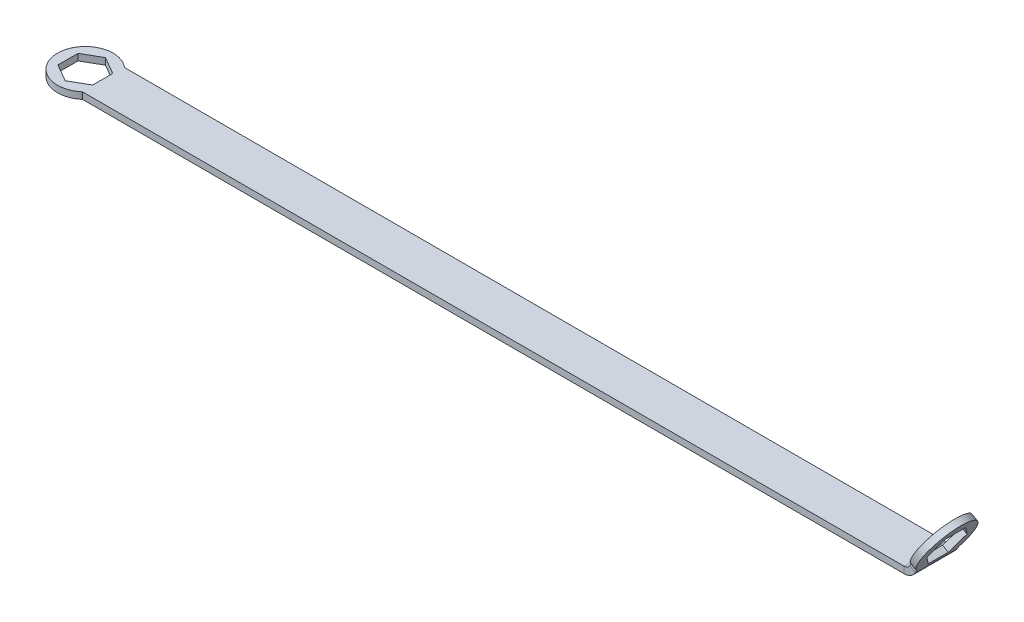
ISO-10303-21;
HEADER;
FILE_DESCRIPTION(('STEP AP214'),'2;1');
FILE_NAME('part.step','',(''),(''),'','','');
FILE_SCHEMA(('AUTOMOTIVE_DESIGN { 1 0 10303 214 1 1 1 1 }'));
ENDSEC;
DATA;
#1=APPLICATION_CONTEXT('core data for automotive mechanical design processes');
#2=APPLICATION_PROTOCOL_DEFINITION('international standard','automotive_design',2000,#1);
#3=PRODUCT_CONTEXT('',#1,'mechanical');
#4=PRODUCT('Part','Part','',(#3));
#5=PRODUCT_RELATED_PRODUCT_CATEGORY('part','',(#4));
#6=PRODUCT_DEFINITION_FORMATION('','',#4);
#7=PRODUCT_DEFINITION_CONTEXT('part definition',#1,'design');
#8=PRODUCT_DEFINITION('design','',#6,#7);
#9=PRODUCT_DEFINITION_SHAPE('','',#8);
#10=(LENGTH_UNIT() NAMED_UNIT(*) SI_UNIT(.MILLI.,.METRE.));
#11=(NAMED_UNIT(*) PLANE_ANGLE_UNIT() SI_UNIT($,.RADIAN.));
#12=(NAMED_UNIT(*) SI_UNIT($,.STERADIAN.) SOLID_ANGLE_UNIT());
#13=UNCERTAINTY_MEASURE_WITH_UNIT(LENGTH_MEASURE(1.E-05),#10,'distance_accuracy_value','');
#14=(GEOMETRIC_REPRESENTATION_CONTEXT(3) GLOBAL_UNCERTAINTY_ASSIGNED_CONTEXT((#13)) GLOBAL_UNIT_ASSIGNED_CONTEXT((#10,
#11,#12)) REPRESENTATION_CONTEXT('',''));
#15=CARTESIAN_POINT('',(0.,0.,0.));
#16=DIRECTION('',(0.,0.,1.));
#17=DIRECTION('',(1.,0.,0.));
#18=AXIS2_PLACEMENT_3D('',#15,#16,#17);
#19=CARTESIAN_POINT('',(47.5532916589868,-81.1957657900333,0.));
#20=DIRECTION('',(-0.86602540378444,0.499999999999998,0.));
#21=DIRECTION('',(0.,0.,1.));
#22=AXIS2_PLACEMENT_3D('',#19,#20,#21);
#23=PLANE('',#22);
#24=DIRECTION('',(0.499999999999998,0.86602540378444,0.));
#25=VECTOR('',#24,1.);
#26=CARTESIAN_POINT('',(47.5532916589868,-81.1957657900333,4.8));
#27=LINE('',#26,#25);
#28=CARTESIAN_POINT('',(94.8647015968123,0.750000000000001,4.8));
#29=VERTEX_POINT('',#28);
#30=CARTESIAN_POINT('',(95.1814166589867,1.29856657920827,4.8));
#31=VERTEX_POINT('',#30);
#32=EDGE_CURVE('E253',#29,#31,#27,.T.);
#33=ORIENTED_EDGE('',*,*,#32,.F.);
#34=DIRECTION('',(0.,0.,-1.));
#35=VECTOR('',#34,1.);
#36=CARTESIAN_POINT('',(94.8647015968123,0.750000000000001,0.));
#37=LINE('',#36,#35);
#38=CARTESIAN_POINT('',(94.8647015968123,0.750000000000001,-4.8));
#39=VERTEX_POINT('',#38);
#40=EDGE_CURVE('E25',#29,#39,#37,.T.);
#41=ORIENTED_EDGE('',*,*,#40,.T.);
#42=DIRECTION('',(0.499999999999998,0.86602540378444,0.));
#43=VECTOR('',#42,1.);
#44=CARTESIAN_POINT('',(47.5532916589868,-81.1957657900333,-4.8));
#45=LINE('',#44,#43);
#46=CARTESIAN_POINT('',(95.1814166589867,1.29856657920827,-4.8));
#47=VERTEX_POINT('',#46);
#48=EDGE_CURVE('E370',#39,#47,#45,.T.);
#49=ORIENTED_EDGE('',*,*,#48,.T.);
#50=CARTESIAN_POINT('',(97.2600279742642,4.89882698645662,0.));
#51=DIRECTION('',(-0.86602540378444,0.499999999999998,0.));
#52=DIRECTION('',(0.,0.,1.));
#53=AXIS2_PLACEMENT_3D('',#50,#51,#52);
#54=CIRCLE('',#53,6.35);
#55=EDGE_CURVE('E366',#31,#47,#54,.T.);
#56=ORIENTED_EDGE('',*,*,#55,.F.);
#57=EDGE_LOOP('',(#33,#41,#49,#56));
#58=FACE_BOUND('',#57,.T.);
#59=DIRECTION('',(0.,0.,1.));
#60=VECTOR('',#59,1.);
#61=CARTESIAN_POINT('',(95.2756529742642,1.46178866518713,0.));
#62=LINE('',#61,#60);
#63=CARTESIAN_POINT('',(95.2756529742642,1.46178866518713,-2.29135888084632));
#64=VERTEX_POINT('',#63);
#65=CARTESIAN_POINT('',(95.2756529742642,1.46178866518713,2.29135888084633));
#66=VERTEX_POINT('',#65);
#67=EDGE_CURVE('E213',#64,#66,#62,.T.);
#68=ORIENTED_EDGE('',*,*,#67,.T.);
#69=DIRECTION('',(0.433012701892217,0.750000000000001,0.500000000000001));
#70=VECTOR('',#69,1.);
#71=CARTESIAN_POINT('',(58.9877882378062,-61.3906367565455,-39.6102580669754));
#72=LINE('',#71,#70);
#73=CARTESIAN_POINT('',(97.2600279742642,4.89882698645664,4.58271776169267));
#74=VERTEX_POINT('',#73);
#75=EDGE_CURVE('E202',#66,#74,#72,.T.);
#76=ORIENTED_EDGE('',*,*,#75,.T.);
#77=DIRECTION('',(0.433012701892218,0.750000000000001,-0.499999999999999));
#78=VECTOR('',#77,1.);
#79=CARTESIAN_POINT('',(60.9721632378061,-57.9535984352761,46.4843347095143));
#80=LINE('',#79,#78);
#81=CARTESIAN_POINT('',(99.2444029742642,8.33586530772613,2.29135888084633));
#82=VERTEX_POINT('',#81);
#83=EDGE_CURVE('E37',#74,#82,#80,.T.);
#84=ORIENTED_EDGE('',*,*,#83,.T.);
#85=DIRECTION('',(0.,0.,1.));
#86=VECTOR('',#85,1.);
#87=CARTESIAN_POINT('',(99.2444029742642,8.33586530772613,0.));
#88=LINE('',#87,#86);
#89=CARTESIAN_POINT('',(99.2444029742642,8.33586530772613,-2.29135888084629));
#90=VERTEX_POINT('',#89);
#91=EDGE_CURVE('E978',#82,#90,#88,.F.);
#92=ORIENTED_EDGE('',*,*,#91,.T.);
#93=DIRECTION('',(-0.433012701892218,-0.750000000000001,-0.500000000000001));
#94=VECTOR('',#93,1.);
#95=CARTESIAN_POINT('',(60.9721632378062,-57.953598435276,-46.4843347095144));
#96=LINE('',#95,#94);
#97=CARTESIAN_POINT('',(97.2600279742642,4.89882698645659,-4.58271776169263));
#98=VERTEX_POINT('',#97);
#99=EDGE_CURVE('E985',#90,#98,#96,.T.);
#100=ORIENTED_EDGE('',*,*,#99,.T.);
#101=DIRECTION('',(-0.433012701892218,-0.750000000000001,0.499999999999999));
#102=VECTOR('',#101,1.);
#103=CARTESIAN_POINT('',(58.9877882378061,-61.3906367565456,39.6102580669754));
#104=LINE('',#103,#102);
#105=EDGE_CURVE('E220',#98,#64,#104,.T.);
#106=ORIENTED_EDGE('',*,*,#105,.T.);
#107=EDGE_LOOP('',(#68,#76,#84,#92,#100,#106));
#108=FACE_BOUND('',#107,.T.);
#109=ADVANCED_FACE('F15',(#58,#108),#23,.F.);
#110=CARTESIAN_POINT('',(46.2542535533102,-80.4457657900333,0.));
#111=DIRECTION('',(-0.86602540378444,0.499999999999998,0.));
#112=DIRECTION('',(0.,0.,1.));
#113=AXIS2_PLACEMENT_3D('',#110,#111,#112);
#114=PLANE('',#113);
#115=DIRECTION('',(0.,0.,-1.));
#116=VECTOR('',#115,1.);
#117=CARTESIAN_POINT('',(93.5656634911357,1.5,0.));
#118=LINE('',#117,#116);
#119=CARTESIAN_POINT('',(93.5656634911357,1.5,4.8));
#120=VERTEX_POINT('',#119);
#121=CARTESIAN_POINT('',(93.5656634911357,1.49999999999999,-4.8));
#122=VERTEX_POINT('',#121);
#123=EDGE_CURVE('E379',#120,#122,#118,.T.);
#124=ORIENTED_EDGE('',*,*,#123,.F.);
#125=DIRECTION('',(0.499999999999998,0.86602540378444,0.));
#126=VECTOR('',#125,1.);
#127=CARTESIAN_POINT('',(46.2542535533102,-80.4457657900333,4.8));
#128=LINE('',#127,#126);
#129=CARTESIAN_POINT('',(93.88237855331,2.04856657920827,4.8));
#130=VERTEX_POINT('',#129);
#131=EDGE_CURVE('E19',#120,#130,#128,.T.);
#132=ORIENTED_EDGE('',*,*,#131,.T.);
#133=CARTESIAN_POINT('',(95.9609898685876,5.64882698645662,0.));
#134=DIRECTION('',(-0.86602540378444,0.499999999999998,0.));
#135=DIRECTION('',(0.,0.,1.));
#136=AXIS2_PLACEMENT_3D('',#133,#134,#135);
#137=CIRCLE('',#136,6.35);
#138=CARTESIAN_POINT('',(93.88237855331,2.04856657920827,-4.8));
#139=VERTEX_POINT('',#138);
#140=EDGE_CURVE('E361',#130,#139,#137,.T.);
#141=ORIENTED_EDGE('',*,*,#140,.T.);
#142=DIRECTION('',(0.499999999999998,0.86602540378444,0.));
#143=VECTOR('',#142,1.);
#144=CARTESIAN_POINT('',(46.2542535533102,-80.4457657900333,-4.8));
#145=LINE('',#144,#143);
#146=EDGE_CURVE('E365',#122,#139,#145,.T.);
#147=ORIENTED_EDGE('',*,*,#146,.F.);
#148=EDGE_LOOP('',(#124,#132,#141,#147));
#149=FACE_BOUND('',#148,.T.);
#150=DIRECTION('',(0.433012701892217,0.750000000000001,0.500000000000001));
#151=VECTOR('',#150,1.);
#152=CARTESIAN_POINT('',(57.6887501321296,-60.6406367565455,-39.6102580669754));
#153=LINE('',#152,#151);
#154=CARTESIAN_POINT('',(93.9766148685876,2.21178866518714,2.29135888084633));
#155=VERTEX_POINT('',#154);
#156=CARTESIAN_POINT('',(95.9609898685876,5.64882698645661,4.58271776169267));
#157=VERTEX_POINT('',#156);
#158=EDGE_CURVE('E209',#155,#157,#153,.T.);
#159=ORIENTED_EDGE('',*,*,#158,.F.);
#160=DIRECTION('',(0.,0.,1.));
#161=VECTOR('',#160,1.);
#162=CARTESIAN_POINT('',(93.9766148685876,2.21178866518713,0.));
#163=LINE('',#162,#161);
#164=CARTESIAN_POINT('',(93.9766148685876,2.21178866518713,-2.29135888084632));
#165=VERTEX_POINT('',#164);
#166=EDGE_CURVE('E47',#165,#155,#163,.T.);
#167=ORIENTED_EDGE('',*,*,#166,.F.);
#168=DIRECTION('',(-0.433012701892218,-0.750000000000001,0.499999999999999));
#169=VECTOR('',#168,1.);
#170=CARTESIAN_POINT('',(57.6887501321295,-60.6406367565456,39.6102580669754));
#171=LINE('',#170,#169);
#172=CARTESIAN_POINT('',(95.9609898685875,5.64882698645659,-4.58271776169263));
#173=VERTEX_POINT('',#172);
#174=EDGE_CURVE('E222',#173,#165,#171,.T.);
#175=ORIENTED_EDGE('',*,*,#174,.F.);
#176=DIRECTION('',(-0.433012701892218,-0.750000000000001,-0.500000000000001));
#177=VECTOR('',#176,1.);
#178=CARTESIAN_POINT('',(59.6731251321295,-57.203598435276,-46.4843347095144));
#179=LINE('',#178,#177);
#180=CARTESIAN_POINT('',(97.9453648685876,9.08586530772613,-2.29135888084629));
#181=VERTEX_POINT('',#180);
#182=EDGE_CURVE('E981',#181,#173,#179,.T.);
#183=ORIENTED_EDGE('',*,*,#182,.F.);
#184=DIRECTION('',(0.,0.,-1.));
#185=VECTOR('',#184,1.);
#186=CARTESIAN_POINT('',(97.9453648685876,9.08586530772613,0.));
#187=LINE('',#186,#185);
#188=CARTESIAN_POINT('',(97.9453648685876,9.08586530772613,2.29135888084633));
#189=VERTEX_POINT('',#188);
#190=EDGE_CURVE('E973',#189,#181,#187,.T.);
#191=ORIENTED_EDGE('',*,*,#190,.F.);
#192=DIRECTION('',(0.433012701892218,0.750000000000001,-0.499999999999999));
#193=VECTOR('',#192,1.);
#194=CARTESIAN_POINT('',(59.6731251321295,-57.2035984352761,46.4843347095143));
#195=LINE('',#194,#193);
#196=EDGE_CURVE('E966',#157,#189,#195,.T.);
#197=ORIENTED_EDGE('',*,*,#196,.F.);
#198=EDGE_LOOP('',(#159,#167,#175,#183,#191,#197));
#199=FACE_BOUND('',#198,.T.);
#200=ADVANCED_FACE('F406',(#149,#199),#114,.T.);
#201=CARTESIAN_POINT('',(95.9609898685876,5.64882698645662,0.));
#202=DIRECTION('',(-0.86602540378444,0.499999999999998,0.));
#203=DIRECTION('',(0.,0.,1.));
#204=AXIS2_PLACEMENT_3D('',#201,#202,#203);
#205=CYLINDRICAL_SURFACE('',#204,6.35);
#206=DIRECTION('',(-0.86602540378444,0.499999999999998,0.));
#207=VECTOR('',#206,1.);
#208=CARTESIAN_POINT('',(93.88237855331,2.04856657920827,4.8));
#209=LINE('',#208,#207);
#210=EDGE_CURVE('E375',#31,#130,#209,.T.);
#211=ORIENTED_EDGE('',*,*,#210,.F.);
#212=ORIENTED_EDGE('',*,*,#55,.T.);
#213=DIRECTION('',(-0.86602540378444,0.499999999999998,0.));
#214=VECTOR('',#213,1.);
#215=CARTESIAN_POINT('',(93.88237855331,2.04856657920827,-4.8));
#216=LINE('',#215,#214);
#217=EDGE_CURVE('E371',#47,#139,#216,.T.);
#218=ORIENTED_EDGE('',*,*,#217,.T.);
#219=ORIENTED_EDGE('',*,*,#140,.F.);
#220=EDGE_LOOP('',(#211,#212,#218,#219));
#221=FACE_BOUND('',#220,.T.);
#222=ADVANCED_FACE('F404',(#221),#205,.T.);
#223=CARTESIAN_POINT('',(46.2542535533102,-80.4457657900333,-4.8));
#224=DIRECTION('',(0.,0.,1.));
#225=DIRECTION('',(0.499999999999998,0.86602540378444,0.));
#226=AXIS2_PLACEMENT_3D('',#223,#224,#225);
#227=PLANE('',#226);
#228=DIRECTION('',(0.86602540378444,-0.499999999999998,0.));
#229=VECTOR('',#228,1.);
#230=CARTESIAN_POINT('',(93.5656634911357,1.5,-4.8));
#231=LINE('',#230,#229);
#232=EDGE_CURVE('E383',#122,#39,#231,.T.);
#233=ORIENTED_EDGE('',*,*,#232,.F.);
#234=ORIENTED_EDGE('',*,*,#146,.T.);
#235=ORIENTED_EDGE('',*,*,#217,.F.);
#236=ORIENTED_EDGE('',*,*,#48,.F.);
#237=EDGE_LOOP('',(#233,#234,#235,#236));
#238=FACE_BOUND('',#237,.T.);
#239=ADVANCED_FACE('F399',(#238),#227,.F.);
#240=CARTESIAN_POINT('',(46.2542535533102,-80.4457657900333,4.8));
#241=DIRECTION('',(0.,0.,1.));
#242=DIRECTION('',(0.499999999999998,0.86602540378444,0.));
#243=AXIS2_PLACEMENT_3D('',#240,#241,#242);
#244=PLANE('',#243);
#245=DIRECTION('',(-0.86602540378444,0.499999999999998,0.));
#246=VECTOR('',#245,1.);
#247=CARTESIAN_POINT('',(93.5656634911357,1.5,4.8));
#248=LINE('',#247,#246);
#249=EDGE_CURVE('E10',#29,#120,#248,.T.);
#250=ORIENTED_EDGE('',*,*,#249,.F.);
#251=ORIENTED_EDGE('',*,*,#32,.T.);
#252=ORIENTED_EDGE('',*,*,#210,.T.);
#253=ORIENTED_EDGE('',*,*,#131,.F.);
#254=EDGE_LOOP('',(#250,#251,#252,#253));
#255=FACE_BOUND('',#254,.T.);
#256=ADVANCED_FACE('F17',(#255),#244,.T.);
#257=CARTESIAN_POINT('',(-99.4134726305552,0.75,0.));
#258=DIRECTION('',(0.,1.,0.));
#259=DIRECTION('',(0.,0.,1.));
#260=AXIS2_PLACEMENT_3D('',#257,#258,#259);
#261=CYLINDRICAL_SURFACE('',#260,6.35);
#262=DIRECTION('',(0.,1.,0.));
#263=VECTOR('',#262,1.);
#264=CARTESIAN_POINT('',(-95.25625,0.75,-4.8));
#265=LINE('',#264,#263);
#266=CARTESIAN_POINT('',(-95.25625,-0.75,-4.8));
#267=VERTEX_POINT('',#266);
#268=CARTESIAN_POINT('',(-95.25625,0.75,-4.8));
#269=VERTEX_POINT('',#268);
#270=EDGE_CURVE('E286',#267,#269,#265,.T.);
#271=ORIENTED_EDGE('',*,*,#270,.F.);
#272=CARTESIAN_POINT('',(-99.4134726305552,-0.75,0.));
#273=DIRECTION('',(0.,1.,0.));
#274=DIRECTION('',(0.,0.,1.));
#275=AXIS2_PLACEMENT_3D('',#272,#273,#274);
#276=CIRCLE('',#275,6.35);
#277=CARTESIAN_POINT('',(-95.25625,-0.75,4.8));
#278=VERTEX_POINT('',#277);
#279=EDGE_CURVE('E354',#267,#278,#276,.T.);
#280=ORIENTED_EDGE('',*,*,#279,.T.);
#281=DIRECTION('',(0.,1.,0.));
#282=VECTOR('',#281,1.);
#283=CARTESIAN_POINT('',(-95.25625,0.75,4.8));
#284=LINE('',#283,#282);
#285=CARTESIAN_POINT('',(-95.25625,0.75,4.8));
#286=VERTEX_POINT('',#285);
#287=EDGE_CURVE('E351',#278,#286,#284,.T.);
#288=ORIENTED_EDGE('',*,*,#287,.T.);
#289=CARTESIAN_POINT('',(-99.4134726305552,0.75,0.));
#290=DIRECTION('',(0.,1.,0.));
#291=DIRECTION('',(0.,0.,1.));
#292=AXIS2_PLACEMENT_3D('',#289,#290,#291);
#293=CIRCLE('',#292,6.35);
#294=EDGE_CURVE('E297',#269,#286,#293,.T.);
#295=ORIENTED_EDGE('',*,*,#294,.F.);
#296=EDGE_LOOP('',(#271,#280,#288,#295));
#297=FACE_BOUND('',#296,.T.);
#298=ADVANCED_FACE('F492',(#297),#261,.T.);
#299=CARTESIAN_POINT('',(-22.8689931576388,0.75,-39.6102580669754));
#300=DIRECTION('',(0.5,0.,0.866025403784439));
#301=DIRECTION('',(0.866025403784439,0.,-0.5));
#302=AXIS2_PLACEMENT_3D('',#299,#300,#301);
#303=PLANE('',#302);
#304=DIRECTION('',(0.,1.,0.));
#305=VECTOR('',#304,1.);
#306=CARTESIAN_POINT('',(-95.4447226305551,0.75,2.29135888084631));
#307=LINE('',#306,#305);
#308=CARTESIAN_POINT('',(-95.4447226305551,-0.75,2.29135888084631));
#309=VERTEX_POINT('',#308);
#310=CARTESIAN_POINT('',(-95.4447226305551,0.75,2.29135888084631));
#311=VERTEX_POINT('',#310);
#312=EDGE_CURVE('E341',#309,#311,#307,.T.);
#313=ORIENTED_EDGE('',*,*,#312,.F.);
#314=DIRECTION('',(0.866025403784439,0.,-0.5));
#315=VECTOR('',#314,1.);
#316=CARTESIAN_POINT('',(-22.8689931576388,-0.75,-39.6102580669754));
#317=LINE('',#316,#315);
#318=CARTESIAN_POINT('',(-99.4134726305552,-0.75,4.58271776169265));
#319=VERTEX_POINT('',#318);
#320=EDGE_CURVE('E274',#319,#309,#317,.T.);
#321=ORIENTED_EDGE('',*,*,#320,.F.);
#322=DIRECTION('',(0.,1.,0.));
#323=VECTOR('',#322,1.);
#324=CARTESIAN_POINT('',(-99.4134726305552,0.75,4.58271776169265));
#325=LINE('',#324,#323);
#326=CARTESIAN_POINT('',(-99.4134726305552,0.75,4.58271776169265));
#327=VERTEX_POINT('',#326);
#328=EDGE_CURVE('E348',#319,#327,#325,.T.);
#329=ORIENTED_EDGE('',*,*,#328,.T.);
#330=DIRECTION('',(0.866025403784439,0.,-0.5));
#331=VECTOR('',#330,1.);
#332=CARTESIAN_POINT('',(-22.8689931576388,0.75,-39.6102580669754));
#333=LINE('',#332,#331);
#334=EDGE_CURVE('E344',#327,#311,#333,.T.);
#335=ORIENTED_EDGE('',*,*,#334,.T.);
#336=EDGE_LOOP('',(#313,#321,#329,#335));
#337=FACE_BOUND('',#336,.T.);
#338=ADVANCED_FACE('F488',(#337),#303,.F.);
#339=CARTESIAN_POINT('',(-95.4447226305552,0.75,0.));
#340=DIRECTION('',(1.,0.,0.));
#341=DIRECTION('',(0.,0.,-1.));
#342=AXIS2_PLACEMENT_3D('',#339,#340,#341);
#343=PLANE('',#342);
#344=DIRECTION('',(0.,1.,0.));
#345=VECTOR('',#344,1.);
#346=CARTESIAN_POINT('',(-95.4447226305552,0.75,-2.29135888084632));
#347=LINE('',#346,#345);
#348=CARTESIAN_POINT('',(-95.4447226305552,-0.75,-2.29135888084632));
#349=VERTEX_POINT('',#348);
#350=CARTESIAN_POINT('',(-95.4447226305552,0.75,-2.29135888084632));
#351=VERTEX_POINT('',#350);
#352=EDGE_CURVE('E334',#349,#351,#347,.T.);
#353=ORIENTED_EDGE('',*,*,#352,.F.);
#354=DIRECTION('',(0.,0.,1.));
#355=VECTOR('',#354,1.);
#356=CARTESIAN_POINT('',(-95.4447226305551,-0.75,0.));
#357=LINE('',#356,#355);
#358=EDGE_CURVE('E270',#309,#349,#357,.F.);
#359=ORIENTED_EDGE('',*,*,#358,.F.);
#360=ORIENTED_EDGE('',*,*,#312,.T.);
#361=DIRECTION('',(0.,0.,-1.));
#362=VECTOR('',#361,1.);
#363=CARTESIAN_POINT('',(-95.4447226305552,0.75,0.));
#364=LINE('',#363,#362);
#365=EDGE_CURVE('E337',#311,#351,#364,.T.);
#366=ORIENTED_EDGE('',*,*,#365,.T.);
#367=EDGE_LOOP('',(#353,#359,#360,#366));
#368=FACE_BOUND('',#367,.T.);
#369=ADVANCED_FACE('F484',(#368),#343,.F.);
#370=CARTESIAN_POINT('',(-22.8689931576388,0.75,39.6102580669754));
#371=DIRECTION('',(0.5,0.,-0.866025403784439));
#372=DIRECTION('',(-0.866025403784439,0.,-0.5));
#373=AXIS2_PLACEMENT_3D('',#370,#371,#372);
#374=PLANE('',#373);
#375=DIRECTION('',(0.,1.,0.));
#376=VECTOR('',#375,1.);
#377=CARTESIAN_POINT('',(-99.4134726305552,0.75,-4.58271776169264));
#378=LINE('',#377,#376);
#379=CARTESIAN_POINT('',(-99.4134726305552,-0.75,-4.58271776169264));
#380=VERTEX_POINT('',#379);
#381=CARTESIAN_POINT('',(-99.4134726305552,0.75,-4.58271776169264));
#382=VERTEX_POINT('',#381);
#383=EDGE_CURVE('E327',#380,#382,#378,.T.);
#384=ORIENTED_EDGE('',*,*,#383,.F.);
#385=DIRECTION('',(-0.866025403784439,0.,-0.5));
#386=VECTOR('',#385,1.);
#387=CARTESIAN_POINT('',(-22.8689931576388,-0.75,39.6102580669754));
#388=LINE('',#387,#386);
#389=EDGE_CURVE('E266',#349,#380,#388,.T.);
#390=ORIENTED_EDGE('',*,*,#389,.F.);
#391=ORIENTED_EDGE('',*,*,#352,.T.);
#392=DIRECTION('',(-0.866025403784439,0.,-0.5));
#393=VECTOR('',#392,1.);
#394=CARTESIAN_POINT('',(-22.8689931576388,0.75,39.6102580669754));
#395=LINE('',#394,#393);
#396=EDGE_CURVE('E330',#351,#382,#395,.T.);
#397=ORIENTED_EDGE('',*,*,#396,.T.);
#398=EDGE_LOOP('',(#384,#390,#391,#397));
#399=FACE_BOUND('',#398,.T.);
#400=ADVANCED_FACE('F480',(#399),#374,.F.);
#401=CARTESIAN_POINT('',(-26.8377431576386,0.75,-46.4843347095143));
#402=DIRECTION('',(-0.499999999999999,0.,-0.86602540378444));
#403=DIRECTION('',(-0.86602540378444,0.,0.499999999999999));
#404=AXIS2_PLACEMENT_3D('',#401,#402,#403);
#405=PLANE('',#404);
#406=DIRECTION('',(0.,1.,0.));
#407=VECTOR('',#406,1.);
#408=CARTESIAN_POINT('',(-103.382222630555,0.75,-2.29135888084632));
#409=LINE('',#408,#407);
#410=CARTESIAN_POINT('',(-103.382222630555,-0.75,-2.29135888084632));
#411=VERTEX_POINT('',#410);
#412=CARTESIAN_POINT('',(-103.382222630555,0.75,-2.29135888084632));
#413=VERTEX_POINT('',#412);
#414=EDGE_CURVE('E320',#411,#413,#409,.T.);
#415=ORIENTED_EDGE('',*,*,#414,.F.);
#416=DIRECTION('',(-0.86602540378444,0.,0.499999999999999));
#417=VECTOR('',#416,1.);
#418=CARTESIAN_POINT('',(-26.8377431576386,-0.75,-46.4843347095143));
#419=LINE('',#418,#417);
#420=EDGE_CURVE('E262',#380,#411,#419,.T.);
#421=ORIENTED_EDGE('',*,*,#420,.F.);
#422=ORIENTED_EDGE('',*,*,#383,.T.);
#423=DIRECTION('',(-0.86602540378444,0.,0.499999999999999));
#424=VECTOR('',#423,1.);
#425=CARTESIAN_POINT('',(-26.8377431576386,0.75,-46.4843347095143));
#426=LINE('',#425,#424);
#427=EDGE_CURVE('E323',#382,#413,#426,.T.);
#428=ORIENTED_EDGE('',*,*,#427,.T.);
#429=EDGE_LOOP('',(#415,#421,#422,#428));
#430=FACE_BOUND('',#429,.T.);
#431=ADVANCED_FACE('F476',(#430),#405,.F.);
#432=CARTESIAN_POINT('',(-103.382222630555,0.75,3.13071112683395E-13));
#433=DIRECTION('',(-1.,0.,0.));
#434=DIRECTION('',(0.,0.,1.));
#435=AXIS2_PLACEMENT_3D('',#432,#433,#434);
#436=PLANE('',#435);
#437=DIRECTION('',(0.,0.,1.));
#438=VECTOR('',#437,1.);
#439=CARTESIAN_POINT('',(-103.382222630555,-0.75,0.));
#440=LINE('',#439,#438);
#441=CARTESIAN_POINT('',(-103.382222630555,-0.75,2.29135888084633));
#442=VERTEX_POINT('',#441);
#443=EDGE_CURVE('E258',#411,#442,#440,.T.);
#444=ORIENTED_EDGE('',*,*,#443,.F.);
#445=ORIENTED_EDGE('',*,*,#414,.T.);
#446=DIRECTION('',(0.,0.,1.));
#447=VECTOR('',#446,1.);
#448=CARTESIAN_POINT('',(-103.382222630555,0.75,3.13071112683395E-13));
#449=LINE('',#448,#447);
#450=CARTESIAN_POINT('',(-103.382222630555,0.75,2.29135888084633));
#451=VERTEX_POINT('',#450);
#452=EDGE_CURVE('E316',#413,#451,#449,.T.);
#453=ORIENTED_EDGE('',*,*,#452,.T.);
#454=DIRECTION('',(0.,1.,0.));
#455=VECTOR('',#454,1.);
#456=CARTESIAN_POINT('',(-103.382222630555,0.75,2.29135888084633));
#457=LINE('',#456,#455);
#458=EDGE_CURVE('E313',#442,#451,#457,.T.);
#459=ORIENTED_EDGE('',*,*,#458,.F.);
#460=EDGE_LOOP('',(#444,#445,#453,#459));
#461=FACE_BOUND('',#460,.T.);
#462=ADVANCED_FACE('F472',(#461),#436,.F.);
#463=CARTESIAN_POINT('',(-26.8377431576388,0.75,46.4843347095144));
#464=DIRECTION('',(-0.5,0.,0.866025403784439));
#465=DIRECTION('',(0.866025403784439,0.,0.5));
#466=AXIS2_PLACEMENT_3D('',#463,#464,#465);
#467=PLANE('',#466);
#468=ORIENTED_EDGE('',*,*,#328,.F.);
#469=DIRECTION('',(0.866025403784439,0.,0.5));
#470=VECTOR('',#469,1.);
#471=CARTESIAN_POINT('',(-26.8377431576388,-0.75,46.4843347095144));
#472=LINE('',#471,#470);
#473=EDGE_CURVE('E278',#442,#319,#472,.T.);
#474=ORIENTED_EDGE('',*,*,#473,.F.);
#475=ORIENTED_EDGE('',*,*,#458,.T.);
#476=DIRECTION('',(0.866025403784439,0.,0.5));
#477=VECTOR('',#476,1.);
#478=CARTESIAN_POINT('',(-26.8377431576388,0.75,46.4843347095144));
#479=LINE('',#478,#477);
#480=EDGE_CURVE('E309',#451,#327,#479,.T.);
#481=ORIENTED_EDGE('',*,*,#480,.T.);
#482=EDGE_LOOP('',(#468,#474,#475,#481));
#483=FACE_BOUND('',#482,.T.);
#484=ADVANCED_FACE('F468',(#483),#467,.F.);
#485=CARTESIAN_POINT('',(0.,0.75,0.));
#486=DIRECTION('',(0.,1.,0.));
#487=DIRECTION('',(0.,0.,1.));
#488=AXIS2_PLACEMENT_3D('',#485,#486,#487);
#489=PLANE('',#488);
#490=ORIENTED_EDGE('',*,*,#480,.F.);
#491=ORIENTED_EDGE('',*,*,#452,.F.);
#492=ORIENTED_EDGE('',*,*,#427,.F.);
#493=ORIENTED_EDGE('',*,*,#396,.F.);
#494=ORIENTED_EDGE('',*,*,#365,.F.);
#495=ORIENTED_EDGE('',*,*,#334,.F.);
#496=EDGE_LOOP('',(#490,#491,#492,#493,#494,#495));
#497=FACE_BOUND('',#496,.T.);
#498=DIRECTION('',(1.,0.,0.));
#499=VECTOR('',#498,1.);
#500=CARTESIAN_POINT('',(0.,0.75,4.8));
#501=LINE('',#500,#499);
#502=CARTESIAN_POINT('',(92.266625385459,0.75,4.8));
#503=VERTEX_POINT('',#502);
#504=EDGE_CURVE('E305',#286,#503,#501,.T.);
#505=ORIENTED_EDGE('',*,*,#504,.T.);
#506=DIRECTION('',(0.,0.,-1.));
#507=VECTOR('',#506,1.);
#508=CARTESIAN_POINT('',(92.266625385459,0.75,0.));
#509=LINE('',#508,#507);
#510=CARTESIAN_POINT('',(92.266625385459,0.75,-4.8));
#511=VERTEX_POINT('',#510);
#512=EDGE_CURVE('E301',#503,#511,#509,.T.);
#513=ORIENTED_EDGE('',*,*,#512,.T.);
#514=DIRECTION('',(1.,0.,0.));
#515=VECTOR('',#514,1.);
#516=CARTESIAN_POINT('',(0.,0.75,-4.8));
#517=LINE('',#516,#515);
#518=EDGE_CURVE('E293',#269,#511,#517,.T.);
#519=ORIENTED_EDGE('',*,*,#518,.F.);
#520=ORIENTED_EDGE('',*,*,#294,.T.);
#521=EDGE_LOOP('',(#505,#513,#519,#520));
#522=FACE_BOUND('',#521,.T.);
#523=ADVANCED_FACE('F435',(#497,#522),#489,.T.);
#524=CARTESIAN_POINT('',(0.,0.75,-4.8));
#525=DIRECTION('',(0.,0.,1.));
#526=DIRECTION('',(1.,0.,0.));
#527=AXIS2_PLACEMENT_3D('',#524,#525,#526);
#528=PLANE('',#527);
#529=ORIENTED_EDGE('',*,*,#518,.T.);
#530=DIRECTION('',(0.,-1.,0.));
#531=VECTOR('',#530,1.);
#532=CARTESIAN_POINT('',(92.266625385459,0.75,-4.8));
#533=LINE('',#532,#531);
#534=CARTESIAN_POINT('',(92.266625385459,-0.75,-4.8));
#535=VERTEX_POINT('',#534);
#536=EDGE_CURVE('E289',#511,#535,#533,.T.);
#537=ORIENTED_EDGE('',*,*,#536,.T.);
#538=DIRECTION('',(1.,0.,0.));
#539=VECTOR('',#538,1.);
#540=CARTESIAN_POINT('',(0.,-0.75,-4.8));
#541=LINE('',#540,#539);
#542=EDGE_CURVE('E282',#267,#535,#541,.T.);
#543=ORIENTED_EDGE('',*,*,#542,.F.);
#544=ORIENTED_EDGE('',*,*,#270,.T.);
#545=EDGE_LOOP('',(#529,#537,#543,#544));
#546=FACE_BOUND('',#545,.T.);
#547=ADVANCED_FACE('F429',(#546),#528,.F.);
#548=CARTESIAN_POINT('',(0.,-0.75,0.));
#549=DIRECTION('',(0.,1.,0.));
#550=DIRECTION('',(0.,0.,1.));
#551=AXIS2_PLACEMENT_3D('',#548,#549,#550);
#552=PLANE('',#551);
#553=DIRECTION('',(0.,0.,-1.));
#554=VECTOR('',#553,1.);
#555=CARTESIAN_POINT('',(92.266625385459,-0.75,0.));
#556=LINE('',#555,#554);
#557=CARTESIAN_POINT('',(92.266625385459,-0.75,4.8));
#558=VERTEX_POINT('',#557);
#559=EDGE_CURVE('E243',#558,#535,#556,.T.);
#560=ORIENTED_EDGE('',*,*,#559,.F.);
#561=DIRECTION('',(1.,0.,0.));
#562=VECTOR('',#561,1.);
#563=CARTESIAN_POINT('',(0.,-0.75,4.8));
#564=LINE('',#563,#562);
#565=EDGE_CURVE('E254',#278,#558,#564,.T.);
#566=ORIENTED_EDGE('',*,*,#565,.F.);
#567=ORIENTED_EDGE('',*,*,#279,.F.);
#568=ORIENTED_EDGE('',*,*,#542,.T.);
#569=EDGE_LOOP('',(#560,#566,#567,#568));
#570=FACE_BOUND('',#569,.T.);
#571=ORIENTED_EDGE('',*,*,#473,.T.);
#572=ORIENTED_EDGE('',*,*,#320,.T.);
#573=ORIENTED_EDGE('',*,*,#358,.T.);
#574=ORIENTED_EDGE('',*,*,#389,.T.);
#575=ORIENTED_EDGE('',*,*,#420,.T.);
#576=ORIENTED_EDGE('',*,*,#443,.T.);
#577=EDGE_LOOP('',(#571,#572,#573,#574,#575,#576));
#578=FACE_BOUND('',#577,.T.);
#579=ADVANCED_FACE('F426',(#570,#578),#552,.F.);
#580=CARTESIAN_POINT('',(0.,0.75,4.8));
#581=DIRECTION('',(0.,0.,1.));
#582=DIRECTION('',(1.,0.,0.));
#583=AXIS2_PLACEMENT_3D('',#580,#581,#582);
#584=PLANE('',#583);
#585=ORIENTED_EDGE('',*,*,#565,.T.);
#586=DIRECTION('',(0.,1.,0.));
#587=VECTOR('',#586,1.);
#588=CARTESIAN_POINT('',(92.266625385459,0.75,4.8));
#589=LINE('',#588,#587);
#590=EDGE_CURVE('E249',#558,#503,#589,.T.);
#591=ORIENTED_EDGE('',*,*,#590,.T.);
#592=ORIENTED_EDGE('',*,*,#504,.F.);
#593=ORIENTED_EDGE('',*,*,#287,.F.);
#594=EDGE_LOOP('',(#585,#591,#592,#593));
#595=FACE_BOUND('',#594,.T.);
#596=ADVANCED_FACE('F439',(#595),#584,.T.);
#597=CARTESIAN_POINT('',(92.266625385459,2.25,4.8));
#598=DIRECTION('',(0.,0.,-1.));
#599=DIRECTION('',(-1.,0.,0.));
#600=AXIS2_PLACEMENT_3D('',#597,#598,#599);
#601=PLANE('',#600);
#602=ORIENTED_EDGE('',*,*,#590,.F.);
#603=CARTESIAN_POINT('',(92.266625385459,2.25,4.8));
#604=DIRECTION('',(0.,0.,-1.));
#605=DIRECTION('',(-1.,0.,0.));
#606=AXIS2_PLACEMENT_3D('',#603,#604,#605);
#607=CIRCLE('',#606,3.);
#608=EDGE_CURVE('E228',#558,#29,#607,.F.);
#609=ORIENTED_EDGE('',*,*,#608,.T.);
#610=ORIENTED_EDGE('',*,*,#249,.T.);
#611=CARTESIAN_POINT('',(92.266625385459,2.25,4.8));
#612=DIRECTION('',(0.,0.,1.));
#613=DIRECTION('',(1.,0.,0.));
#614=AXIS2_PLACEMENT_3D('',#611,#612,#613);
#615=CIRCLE('',#614,1.5);
#616=EDGE_CURVE('E234',#503,#120,#615,.T.);
#617=ORIENTED_EDGE('',*,*,#616,.F.);
#618=EDGE_LOOP('',(#602,#609,#610,#617));
#619=FACE_BOUND('',#618,.T.);
#620=ADVANCED_FACE('F441',(#619),#601,.F.);
#621=CARTESIAN_POINT('',(92.266625385459,2.25,-4.8));
#622=DIRECTION('',(0.,0.,1.));
#623=DIRECTION('',(1.,0.,0.));
#624=AXIS2_PLACEMENT_3D('',#621,#622,#623);
#625=PLANE('',#624);
#626=CARTESIAN_POINT('',(92.266625385459,2.25,-4.8));
#627=DIRECTION('',(0.,0.,-1.));
#628=DIRECTION('',(-1.,0.,0.));
#629=AXIS2_PLACEMENT_3D('',#626,#627,#628);
#630=CIRCLE('',#629,3.);
#631=EDGE_CURVE('E239',#39,#535,#630,.T.);
#632=ORIENTED_EDGE('',*,*,#631,.T.);
#633=ORIENTED_EDGE('',*,*,#536,.F.);
#634=CARTESIAN_POINT('',(92.266625385459,2.25,-4.8));
#635=DIRECTION('',(0.,0.,-1.));
#636=DIRECTION('',(1.,0.,0.));
#637=AXIS2_PLACEMENT_3D('',#634,#635,#636);
#638=CIRCLE('',#637,1.5);
#639=EDGE_CURVE('E238',#122,#511,#638,.T.);
#640=ORIENTED_EDGE('',*,*,#639,.F.);
#641=ORIENTED_EDGE('',*,*,#232,.T.);
#642=EDGE_LOOP('',(#632,#633,#640,#641));
#643=FACE_BOUND('',#642,.T.);
#644=ADVANCED_FACE('F419',(#643),#625,.F.);
#645=CARTESIAN_POINT('',(92.266625385459,2.25,9.9980824399288));
#646=DIRECTION('',(0.,0.,-1.));
#647=DIRECTION('',(-1.,0.,0.));
#648=AXIS2_PLACEMENT_3D('',#645,#646,#647);
#649=CYLINDRICAL_SURFACE('',#648,1.5);
#650=ORIENTED_EDGE('',*,*,#123,.T.);
#651=ORIENTED_EDGE('',*,*,#639,.T.);
#652=ORIENTED_EDGE('',*,*,#512,.F.);
#653=ORIENTED_EDGE('',*,*,#616,.T.);
#654=EDGE_LOOP('',(#650,#651,#652,#653));
#655=FACE_BOUND('',#654,.T.);
#656=ADVANCED_FACE('F432',(#655),#649,.F.);
#657=CARTESIAN_POINT('',(92.266625385459,2.25,9.9980824399288));
#658=DIRECTION('',(0.,0.,-1.));
#659=DIRECTION('',(-1.,0.,0.));
#660=AXIS2_PLACEMENT_3D('',#657,#658,#659);
#661=CYLINDRICAL_SURFACE('',#660,3.);
#662=ORIENTED_EDGE('',*,*,#40,.F.);
#663=ORIENTED_EDGE('',*,*,#608,.F.);
#664=ORIENTED_EDGE('',*,*,#559,.T.);
#665=ORIENTED_EDGE('',*,*,#631,.F.);
#666=EDGE_LOOP('',(#662,#663,#664,#665));
#667=FACE_BOUND('',#666,.T.);
#668=ADVANCED_FACE('F420',(#667),#661,.T.);
#669=CARTESIAN_POINT('',(93.9766148685876,2.21178866518713,0.));
#670=DIRECTION('',(-0.499999999999998,-0.86602540378444,0.));
#671=DIRECTION('',(0.,0.,1.));
#672=AXIS2_PLACEMENT_3D('',#669,#670,#671);
#673=PLANE('',#672);
#674=ORIENTED_EDGE('',*,*,#67,.F.);
#675=DIRECTION('',(-0.86602540378444,0.499999999999998,0.));
#676=VECTOR('',#675,1.);
#677=CARTESIAN_POINT('',(93.9766148685876,2.21178866518713,-2.29135888084632));
#678=LINE('',#677,#676);
#679=EDGE_CURVE('E984',#64,#165,#678,.T.);
#680=ORIENTED_EDGE('',*,*,#679,.T.);
#681=ORIENTED_EDGE('',*,*,#166,.T.);
#682=DIRECTION('',(-0.86602540378444,0.499999999999998,0.));
#683=VECTOR('',#682,1.);
#684=CARTESIAN_POINT('',(93.9766148685876,2.21178866518713,2.29135888084633));
#685=LINE('',#684,#683);
#686=EDGE_CURVE('E204',#66,#155,#685,.T.);
#687=ORIENTED_EDGE('',*,*,#686,.F.);
#688=EDGE_LOOP('',(#674,#680,#681,#687));
#689=FACE_BOUND('',#688,.T.);
#690=ADVANCED_FACE('F212',(#689),#673,.F.);
#691=CARTESIAN_POINT('',(57.6887501321295,-60.6406367565456,39.6102580669754));
#692=DIRECTION('',(-0.249999999999999,-0.433012701892219,-0.866025403784439));
#693=DIRECTION('',(-0.433012701892218,-0.750000000000001,0.499999999999999));
#694=AXIS2_PLACEMENT_3D('',#691,#692,#693);
#695=PLANE('',#694);
#696=ORIENTED_EDGE('',*,*,#679,.F.);
#697=ORIENTED_EDGE('',*,*,#105,.F.);
#698=DIRECTION('',(-0.86602540378444,0.499999999999998,0.));
#699=VECTOR('',#698,1.);
#700=CARTESIAN_POINT('',(95.9609898685875,5.64882698645659,-4.58271776169263));
#701=LINE('',#700,#699);
#702=EDGE_CURVE('E977',#98,#173,#701,.T.);
#703=ORIENTED_EDGE('',*,*,#702,.T.);
#704=ORIENTED_EDGE('',*,*,#174,.T.);
#705=EDGE_LOOP('',(#696,#697,#703,#704));
#706=FACE_BOUND('',#705,.T.);
#707=ADVANCED_FACE('F534',(#706),#695,.F.);
#708=CARTESIAN_POINT('',(59.6731251321295,-57.203598435276,-46.4843347095144));
#709=DIRECTION('',(0.249999999999999,0.43301270189222,-0.866025403784438));
#710=DIRECTION('',(-0.433012701892218,-0.750000000000001,-0.500000000000001));
#711=AXIS2_PLACEMENT_3D('',#708,#709,#710);
#712=PLANE('',#711);
#713=ORIENTED_EDGE('',*,*,#702,.F.);
#714=ORIENTED_EDGE('',*,*,#99,.F.);
#715=DIRECTION('',(-0.86602540378444,0.499999999999998,0.));
#716=VECTOR('',#715,1.);
#717=CARTESIAN_POINT('',(97.9453648685876,9.08586530772613,-2.29135888084629));
#718=LINE('',#717,#716);
#719=EDGE_CURVE('E970',#90,#181,#718,.T.);
#720=ORIENTED_EDGE('',*,*,#719,.T.);
#721=ORIENTED_EDGE('',*,*,#182,.T.);
#722=EDGE_LOOP('',(#713,#714,#720,#721));
#723=FACE_BOUND('',#722,.T.);
#724=ADVANCED_FACE('F546',(#723),#712,.F.);
#725=CARTESIAN_POINT('',(97.9453648685876,9.08586530772613,0.));
#726=DIRECTION('',(0.499999999999998,0.86602540378444,0.));
#727=DIRECTION('',(0.,0.,-1.));
#728=AXIS2_PLACEMENT_3D('',#725,#726,#727);
#729=PLANE('',#728);
#730=ORIENTED_EDGE('',*,*,#719,.F.);
#731=ORIENTED_EDGE('',*,*,#91,.F.);
#732=DIRECTION('',(-0.86602540378444,0.499999999999998,0.));
#733=VECTOR('',#732,1.);
#734=CARTESIAN_POINT('',(97.9453648685876,9.08586530772613,2.29135888084633));
#735=LINE('',#734,#733);
#736=EDGE_CURVE('E216',#82,#189,#735,.T.);
#737=ORIENTED_EDGE('',*,*,#736,.T.);
#738=ORIENTED_EDGE('',*,*,#190,.T.);
#739=EDGE_LOOP('',(#730,#731,#737,#738));
#740=FACE_BOUND('',#739,.T.);
#741=ADVANCED_FACE('F557',(#740),#729,.F.);
#742=CARTESIAN_POINT('',(59.6731251321295,-57.2035984352761,46.4843347095143));
#743=DIRECTION('',(0.249999999999999,0.433012701892219,0.866025403784439));
#744=DIRECTION('',(0.433012701892218,0.750000000000001,-0.499999999999999));
#745=AXIS2_PLACEMENT_3D('',#742,#743,#744);
#746=PLANE('',#745);
#747=ORIENTED_EDGE('',*,*,#736,.F.);
#748=ORIENTED_EDGE('',*,*,#83,.F.);
#749=DIRECTION('',(-0.86602540378444,0.499999999999998,0.));
#750=VECTOR('',#749,1.);
#751=CARTESIAN_POINT('',(95.9609898685876,5.64882698645661,4.58271776169267));
#752=LINE('',#751,#750);
#753=EDGE_CURVE('E206',#74,#157,#752,.T.);
#754=ORIENTED_EDGE('',*,*,#753,.T.);
#755=ORIENTED_EDGE('',*,*,#196,.T.);
#756=EDGE_LOOP('',(#747,#748,#754,#755));
#757=FACE_BOUND('',#756,.T.);
#758=ADVANCED_FACE('F568',(#757),#746,.F.);
#759=CARTESIAN_POINT('',(57.6887501321296,-60.6406367565455,-39.6102580669754));
#760=DIRECTION('',(-0.249999999999999,-0.433012701892221,0.866025403784438));
#761=DIRECTION('',(0.433012701892217,0.750000000000001,0.500000000000001));
#762=AXIS2_PLACEMENT_3D('',#759,#760,#761);
#763=PLANE('',#762);
#764=ORIENTED_EDGE('',*,*,#753,.F.);
#765=ORIENTED_EDGE('',*,*,#75,.F.);
#766=ORIENTED_EDGE('',*,*,#686,.T.);
#767=ORIENTED_EDGE('',*,*,#158,.T.);
#768=EDGE_LOOP('',(#764,#765,#766,#767));
#769=FACE_BOUND('',#768,.T.);
#770=ADVANCED_FACE('F203',(#769),#763,.F.);
#771=CLOSED_SHELL('',(#109,#200,#222,#239,#256,#298,#338,#369,#400,#431,#462,#484,#523,#547,
#579,#596,#620,#644,#656,#668,#690,#707,#724,#741,#758,#770));
#772=MANIFOLD_SOLID_BREP('B1',#771);
#773=ADVANCED_BREP_SHAPE_REPRESENTATION('',(#18,#772),#14);
#774=SHAPE_DEFINITION_REPRESENTATION(#9,#773);
ENDSEC;
END-ISO-10303-21;
